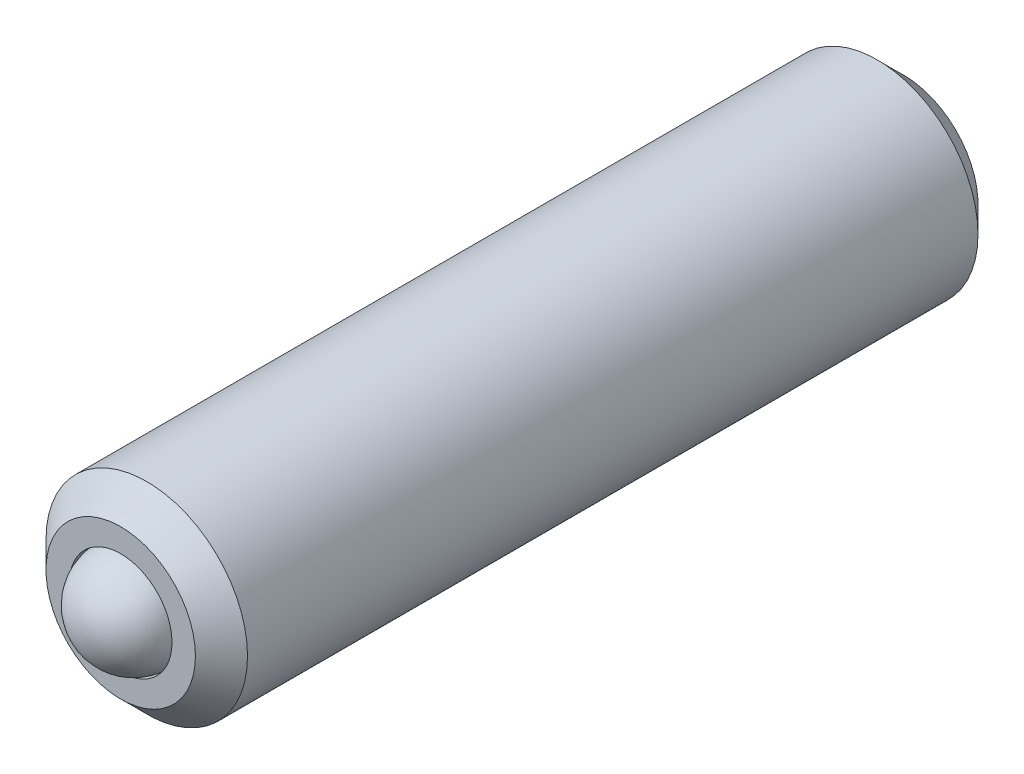
ISO-10303-21;
HEADER;
FILE_DESCRIPTION(('STEP AP214'),'2;1');
FILE_NAME('part.step','',(''),(''),'','','');
FILE_SCHEMA(('AUTOMOTIVE_DESIGN { 1 0 10303 214 1 1 1 1 }'));
ENDSEC;
DATA;
#1=APPLICATION_CONTEXT('core data for automotive mechanical design processes');
#2=APPLICATION_PROTOCOL_DEFINITION('international standard','automotive_design',2000,#1);
#3=PRODUCT_CONTEXT('',#1,'mechanical');
#4=PRODUCT('Part','Part','',(#3));
#5=PRODUCT_RELATED_PRODUCT_CATEGORY('part','',(#4));
#6=PRODUCT_DEFINITION_FORMATION('','',#4);
#7=PRODUCT_DEFINITION_CONTEXT('part definition',#1,'design');
#8=PRODUCT_DEFINITION('design','',#6,#7);
#9=PRODUCT_DEFINITION_SHAPE('','',#8);
#10=(LENGTH_UNIT() NAMED_UNIT(*) SI_UNIT(.MILLI.,.METRE.));
#11=(NAMED_UNIT(*) PLANE_ANGLE_UNIT() SI_UNIT($,.RADIAN.));
#12=(NAMED_UNIT(*) SI_UNIT($,.STERADIAN.) SOLID_ANGLE_UNIT());
#13=UNCERTAINTY_MEASURE_WITH_UNIT(LENGTH_MEASURE(1.E-05),#10,'distance_accuracy_value','');
#14=(GEOMETRIC_REPRESENTATION_CONTEXT(3) GLOBAL_UNCERTAINTY_ASSIGNED_CONTEXT((#13)) GLOBAL_UNIT_ASSIGNED_CONTEXT((#10,
#11,#12)) REPRESENTATION_CONTEXT('',''));
#15=CARTESIAN_POINT('',(0.,0.,0.));
#16=DIRECTION('',(0.,0.,1.));
#17=DIRECTION('',(1.,0.,0.));
#18=AXIS2_PLACEMENT_3D('',#15,#16,#17);
#19=CARTESIAN_POINT('',(-20.3726789582106,-21.6800178280325,29.1976536109388));
#20=DIRECTION('',(-0.249145001310561,-0.908967438814803,-0.334222924851688));
#21=DIRECTION('',(-0.928406450180372,0.322395159622823,-0.184723643086787));
#22=AXIS2_PLACEMENT_3D('',#19,#20,#21);
#23=SPHERICAL_SURFACE('',#22,0.5);
#24=CARTESIAN_POINT('',(-20.4972514588659,-22.1345015474399,29.0305421485129));
#25=VERTEX_POINT('',#24);
#26=VERTEX_LOOP('',#25);
#27=FACE_BOUND('',#26,.T.);
#28=ADVANCED_FACE('P0_F11',(#27),#23,.T.);
#29=CLOSED_SHELL('',(#28));
#30=MANIFOLD_SOLID_BREP('P0_B1',#29);
#31=CARTESIAN_POINT('',(-20.3726789582106,-21.6800178280323,29.3246536109386));
#32=DIRECTION('',(0.,0.,-1.));
#33=DIRECTION('',(-1.,0.,0.));
#34=AXIS2_PLACEMENT_3D('',#31,#32,#33);
#35=CYLINDRICAL_SURFACE('',#34,0.982);
#36=CARTESIAN_POINT('',(-20.3726789582106,-21.6800178280323,21.9516536109386));
#37=DIRECTION('',(0.,0.,-1.));
#38=DIRECTION('',(-1.,0.,0.));
#39=AXIS2_PLACEMENT_3D('',#36,#37,#38);
#40=CIRCLE('',#39,0.982);
#41=CARTESIAN_POINT('',(-21.3546789582106,-21.6800178280323,21.9516536109386));
#42=VERTEX_POINT('',#41);
#43=EDGE_CURVE('P1_E205',#42,#42,#40,.F.);
#44=ORIENTED_EDGE('',*,*,#43,.T.);
#45=EDGE_LOOP('',(#44));
#46=FACE_BOUND('',#45,.T.);
#47=CARTESIAN_POINT('',(-20.3726789582106,-21.6800178280323,29.0706536109386));
#48=DIRECTION('',(0.,0.,1.));
#49=DIRECTION('',(1.,0.,0.));
#50=AXIS2_PLACEMENT_3D('',#47,#48,#49);
#51=CIRCLE('',#50,0.982);
#52=CARTESIAN_POINT('',(-19.3906789582106,-21.6800178280323,29.0706536109386));
#53=VERTEX_POINT('',#52);
#54=EDGE_CURVE('P1_E209',#53,#53,#51,.F.);
#55=ORIENTED_EDGE('',*,*,#54,.T.);
#56=EDGE_LOOP('',(#55));
#57=FACE_BOUND('',#56,.T.);
#58=ADVANCED_FACE('P1_F15',(#46,#57),#35,.T.);
#59=CARTESIAN_POINT('',(-20.3726789582106,-21.6800178280323,29.3246536109386));
#60=DIRECTION('',(0.,0.,1.));
#61=DIRECTION('',(1.,0.,0.));
#62=AXIS2_PLACEMENT_3D('',#59,#60,#61);
#63=PLANE('',#62);
#64=CARTESIAN_POINT('',(-20.3726789582106,-21.6800178280323,29.3246536109386));
#65=DIRECTION('',(0.,0.,1.));
#66=DIRECTION('',(1.,0.,0.));
#67=AXIS2_PLACEMENT_3D('',#64,#65,#66);
#68=CIRCLE('',#67,0.728000000000002);
#69=CARTESIAN_POINT('',(-19.6446789582106,-21.6800178280323,29.3246536109386));
#70=VERTEX_POINT('',#69);
#71=EDGE_CURVE('P1_E29',#70,#70,#68,.T.);
#72=ORIENTED_EDGE('',*,*,#71,.T.);
#73=EDGE_LOOP('',(#72));
#74=FACE_BOUND('',#73,.T.);
#75=CARTESIAN_POINT('',(-20.3726789582106,-21.6800178280323,29.3246536109386));
#76=DIRECTION('',(0.,0.,1.));
#77=DIRECTION('',(1.,0.,0.));
#78=AXIS2_PLACEMENT_3D('',#75,#76,#77);
#79=CIRCLE('',#78,0.5);
#80=CARTESIAN_POINT('',(-19.8726789582106,-21.6800178280323,29.3246536109386));
#81=VERTEX_POINT('',#80);
#82=EDGE_CURVE('P1_E210',#81,#81,#79,.T.);
#83=ORIENTED_EDGE('',*,*,#82,.F.);
#84=EDGE_LOOP('',(#83));
#85=FACE_BOUND('',#84,.T.);
#86=ADVANCED_FACE('P1_F181',(#74,#85),#63,.T.);
#87=CARTESIAN_POINT('',(-20.3726789582106,-21.6800178280323,29.3246536109386));
#88=DIRECTION('',(0.,0.,1.));
#89=DIRECTION('',(1.,0.,0.));
#90=AXIS2_PLACEMENT_3D('',#87,#88,#89);
#91=CYLINDRICAL_SURFACE('',#90,0.5);
#92=CARTESIAN_POINT('',(-20.3726789582106,-21.6800178280323,28.9905468297521));
#93=DIRECTION('',(0.,0.,1.));
#94=DIRECTION('',(1.,0.,0.));
#95=AXIS2_PLACEMENT_3D('',#92,#93,#94);
#96=CIRCLE('',#95,0.5);
#97=CARTESIAN_POINT('',(-19.8726789582106,-21.6800178280323,28.9905468297521));
#98=VERTEX_POINT('',#97);
#99=EDGE_CURVE('P1_E215',#98,#98,#96,.T.);
#100=ORIENTED_EDGE('',*,*,#99,.F.);
#101=EDGE_LOOP('',(#100));
#102=FACE_BOUND('',#101,.T.);
#103=ORIENTED_EDGE('',*,*,#82,.T.);
#104=EDGE_LOOP('',(#103));
#105=FACE_BOUND('',#104,.T.);
#106=ADVANCED_FACE('P1_F187',(#102,#105),#91,.F.);
#107=CARTESIAN_POINT('',(-20.3726789582106,-21.6800178280323,28.9905468297521));
#108=DIRECTION('',(0.,0.,1.));
#109=DIRECTION('',(1.,0.,0.));
#110=AXIS2_PLACEMENT_3D('',#107,#108,#109);
#111=CONICAL_SURFACE('',#110,0.5,0.785398163397443);
#112=CARTESIAN_POINT('',(-20.3726789582106,-21.6800178280323,28.4905468297521));
#113=VERTEX_POINT('',#112);
#114=VERTEX_LOOP('',#113);
#115=FACE_BOUND('',#114,.T.);
#116=ORIENTED_EDGE('',*,*,#99,.T.);
#117=EDGE_LOOP('',(#116));
#118=FACE_BOUND('',#117,.T.);
#119=ADVANCED_FACE('P1_F201',(#115,#118),#111,.F.);
#120=CARTESIAN_POINT('',(-20.3726789582106,-21.6800178280323,21.6976536109386));
#121=DIRECTION('',(0.,0.,-1.));
#122=DIRECTION('',(-1.,0.,0.));
#123=AXIS2_PLACEMENT_3D('',#120,#121,#122);
#124=PLANE('',#123);
#125=CARTESIAN_POINT('',(-20.3726789582106,-21.6800178280323,21.6976536109386));
#126=DIRECTION('',(0.,0.,-1.));
#127=DIRECTION('',(-1.,0.,0.));
#128=AXIS2_PLACEMENT_3D('',#125,#126,#127);
#129=CIRCLE('',#128,0.635);
#130=CARTESIAN_POINT('',(-20.9226050896137,-21.3625178280323,21.6976536109386));
#131=VERTEX_POINT('',#130);
#132=CARTESIAN_POINT('',(-20.3726789582106,-21.0450178280323,21.6976536109386));
#133=VERTEX_POINT('',#132);
#134=EDGE_CURVE('P1_E35',#131,#133,#129,.T.);
#135=ORIENTED_EDGE('',*,*,#134,.F.);
#136=CARTESIAN_POINT('',(-20.9226050896137,-21.9975178280323,21.6976536109386));
#137=VERTEX_POINT('',#136);
#138=EDGE_CURVE('P1_E42',#137,#131,#129,.T.);
#139=ORIENTED_EDGE('',*,*,#138,.F.);
#140=CARTESIAN_POINT('',(-20.3726789582106,-22.3150178280323,21.6976536109386));
#141=VERTEX_POINT('',#140);
#142=EDGE_CURVE('P1_E115',#141,#137,#129,.T.);
#143=ORIENTED_EDGE('',*,*,#142,.F.);
#144=CARTESIAN_POINT('',(-19.8227528268075,-21.9975178280323,21.6976536109386));
#145=VERTEX_POINT('',#144);
#146=EDGE_CURVE('P1_E114',#145,#141,#129,.T.);
#147=ORIENTED_EDGE('',*,*,#146,.F.);
#148=CARTESIAN_POINT('',(-19.8227528268075,-21.3625178280323,21.6976536109386));
#149=VERTEX_POINT('',#148);
#150=EDGE_CURVE('P1_E85',#149,#145,#129,.T.);
#151=ORIENTED_EDGE('',*,*,#150,.F.);
#152=EDGE_CURVE('P1_E77',#133,#149,#129,.T.);
#153=ORIENTED_EDGE('',*,*,#152,.F.);
#154=EDGE_LOOP('',(#135,#139,#143,#147,#151,#153));
#155=FACE_BOUND('',#154,.T.);
#156=CARTESIAN_POINT('',(-20.3726789582106,-21.6800178280323,21.6976536109386));
#157=DIRECTION('',(0.,0.,-1.));
#158=DIRECTION('',(-1.,0.,0.));
#159=AXIS2_PLACEMENT_3D('',#156,#157,#158);
#160=CIRCLE('',#159,0.728000000000001);
#161=CARTESIAN_POINT('',(-21.1006789582106,-21.6800178280323,21.6976536109386));
#162=VERTEX_POINT('',#161);
#163=EDGE_CURVE('P1_E208',#162,#162,#160,.T.);
#164=ORIENTED_EDGE('',*,*,#163,.T.);
#165=EDGE_LOOP('',(#164));
#166=FACE_BOUND('',#165,.T.);
#167=ADVANCED_FACE('P1_F111',(#155,#166),#124,.T.);
#168=CARTESIAN_POINT('',(-20.3726789582106,-21.6800178280323,21.6976536109386));
#169=DIRECTION('',(0.,0.,1.));
#170=DIRECTION('',(1.,0.,0.));
#171=AXIS2_PLACEMENT_3D('',#168,#169,#170);
#172=CONICAL_SURFACE('',#171,0.728000000000001,0.785398163397445);
#173=ORIENTED_EDGE('',*,*,#43,.F.);
#174=EDGE_LOOP('',(#173));
#175=FACE_BOUND('',#174,.T.);
#176=ORIENTED_EDGE('',*,*,#163,.F.);
#177=EDGE_LOOP('',(#176));
#178=FACE_BOUND('',#177,.T.);
#179=ADVANCED_FACE('P1_F193',(#175,#178),#172,.T.);
#180=CARTESIAN_POINT('',(-20.3726789582106,-21.6800178280323,29.3246536109386));
#181=DIRECTION('',(0.,0.,-1.));
#182=DIRECTION('',(-1.,0.,0.));
#183=AXIS2_PLACEMENT_3D('',#180,#181,#182);
#184=CONICAL_SURFACE('',#183,0.728000000000002,0.785398163397446);
#185=ORIENTED_EDGE('',*,*,#54,.F.);
#186=EDGE_LOOP('',(#185));
#187=FACE_BOUND('',#186,.T.);
#188=ORIENTED_EDGE('',*,*,#71,.F.);
#189=EDGE_LOOP('',(#188));
#190=FACE_BOUND('',#189,.T.);
#191=ADVANCED_FACE('P1_F17',(#187,#190),#184,.T.);
#192=CARTESIAN_POINT('',(-20.3726789582106,-21.6800178280323,21.6976536109386));
#193=DIRECTION('',(0.,0.,-1.));
#194=DIRECTION('',(-1.,0.,0.));
#195=AXIS2_PLACEMENT_3D('',#192,#193,#194);
#196=CONICAL_SURFACE('',#195,0.635,0.785398163397448);
#197=ORIENTED_EDGE('',*,*,#150,.T.);
#198=CARTESIAN_POINT('',(-19.8227528268075,-22.3132424180526,21.4939688481067));
#199=CARTESIAN_POINT('',(-19.8227528268075,-22.2823909001988,21.5172099146467));
#200=CARTESIAN_POINT('',(-19.8227528268075,-22.251213105695,21.5400657672439));
#201=CARTESIAN_POINT('',(-19.8227528268075,-22.1876683318533,21.5845978100546));
#202=CARTESIAN_POINT('',(-19.8227528268075,-22.1552939755965,21.6062634124289));
#203=CARTESIAN_POINT('',(-19.8227528268075,-22.0874077420275,21.6488053700118));
#204=CARTESIAN_POINT('',(-19.8227528268075,-22.0518222540965,21.6695660895886));
#205=CARTESIAN_POINT('',(-19.8227528268075,-21.9788753698091,21.7075398785935));
#206=CARTESIAN_POINT('',(-19.8227528268075,-21.9415205046393,21.7247649078766));
#207=CARTESIAN_POINT('',(-19.8227528268075,-21.8854448981861,21.745836675686));
#208=CARTESIAN_POINT('',(-19.8227528268075,-21.8675573175111,21.7518841724672));
#209=CARTESIAN_POINT('',(-19.8227528268075,-21.8313599064794,21.7625469846191));
#210=CARTESIAN_POINT('',(-19.8227528268075,-21.8130500471268,21.7671622013257));
#211=CARTESIAN_POINT('',(-19.8227528268075,-21.7582538947398,21.7783144363237));
#212=CARTESIAN_POINT('',(-19.8227528268075,-21.7212188185361,21.7824322878855));
#213=CARTESIAN_POINT('',(-19.8227528268075,-21.6484324748955,21.7829814276612));
#214=CARTESIAN_POINT('',(-19.8227528268075,-21.6126832296478,21.779685381868));
#215=CARTESIAN_POINT('',(-19.8227528268075,-21.5596850471876,21.7699965410882));
#216=CARTESIAN_POINT('',(-19.8227528268075,-21.5419653393718,21.7659167333374));
#217=CARTESIAN_POINT('',(-19.8227528268075,-21.5069051321472,21.7563687164214));
#218=CARTESIAN_POINT('',(-19.8227528268075,-21.4895646011404,21.750900623429));
#219=CARTESIAN_POINT('',(-19.8227528268075,-21.4349719835981,21.7316271233804));
#220=CARTESIAN_POINT('',(-19.8227528268075,-21.3984994679091,21.7156258356001));
#221=CARTESIAN_POINT('',(-19.8227528268075,-21.3272665774506,21.6800464298624));
#222=CARTESIAN_POINT('',(-19.8227528268075,-21.2925129426756,21.6604554613015));
#223=CARTESIAN_POINT('',(-19.8227528268075,-21.2260925272151,21.6200491862186));
#224=CARTESIAN_POINT('',(-19.8227528268075,-21.1943581718682,21.5993430981416));
#225=CARTESIAN_POINT('',(-19.8227528268075,-21.1321139938961,21.556683468646));
#226=CARTESIAN_POINT('',(-19.8227528268075,-21.1015962806024,21.5347415110731));
#227=CARTESIAN_POINT('',(-19.8227528268075,-21.0714135593255,21.5123988298564));
#228=B_SPLINE_CURVE_WITH_KNOTS('',3,(#198,#199,#200,#201,#202,#203,#204,#205,#206,#207,#208,
#209,#210,#211,#212,#213,#214,#215,#216,#217,#218,#219,#220,#221,#222,#223,#224,#225,#226,#227),
.UNSPECIFIED.,.F.,.F.,(4,2,2,2,2,2,2,2,2,2,2,2,2,2,4),(0.,0.115919377669942,0.232742618789015,
0.356233992025999,0.479300496450956,0.535894602508558,0.592492606248893,0.70351197570278,
0.810515319981281,0.865016025394726,0.919512171643782,1.03864987361044,1.15822271572585,
1.27185363992294,1.38455547987617),.UNSPECIFIED.);
#229=EDGE_CURVE('P1_E10',#149,#145,#228,.F.);
#230=ORIENTED_EDGE('',*,*,#229,.F.);
#231=EDGE_LOOP('',(#197,#230));
#232=FACE_BOUND('',#231,.T.);
#233=ADVANCED_FACE('P1_F89',(#232),#196,.F.);
#234=ORIENTED_EDGE('',*,*,#146,.T.);
#235=CARTESIAN_POINT('',(-19.8225528268075,-21.9974023579785,21.6975381093944));
#236=CARTESIAN_POINT('',(-19.8414669625538,-22.0083224393431,21.7084524302981));
#237=CARTESIAN_POINT('',(-19.8606961875254,-22.0194244375567,21.71872717383));
#238=CARTESIAN_POINT('',(-19.8999072672086,-22.0420629649671,21.7375408256984));
#239=CARTESIAN_POINT('',(-19.9198928595233,-22.0536016520698,21.7460692531147));
#240=CARTESIAN_POINT('',(-19.9601955108029,-22.0768703986352,21.7606770486525));
#241=CARTESIAN_POINT('',(-19.9805022431313,-22.0885944960113,21.7667932092107));
#242=CARTESIAN_POINT('',(-20.0215531900858,-22.112295271286,21.7762242903237));
#243=CARTESIAN_POINT('',(-20.0422961720922,-22.1242712375312,21.7795462373648));
#244=CARTESIAN_POINT('',(-20.0929595076962,-22.1535217279803,21.7837606231526));
#245=CARTESIAN_POINT('',(-20.1229981860392,-22.1708645670077,21.7829986883647));
#246=CARTESIAN_POINT('',(-20.1824459599577,-22.2051867552822,21.775144622515));
#247=CARTESIAN_POINT('',(-20.211854047887,-22.2221655227646,21.7680430358229));
#248=CARTESIAN_POINT('',(-20.2635065321753,-22.2519870984727,21.7509150189757));
#249=CARTESIAN_POINT('',(-20.2859881482107,-22.2649668655426,21.7417811894753));
#250=CARTESIAN_POINT('',(-20.3300702917655,-22.2904177029904,21.7212043916752));
#251=CARTESIAN_POINT('',(-20.3516734171265,-22.302890273233,21.709768933685));
#252=CARTESIAN_POINT('',(-20.3728789582106,-22.3151332980861,21.6975381093944));
#253=B_SPLINE_CURVE_WITH_KNOTS('',3,(#235,#236,#237,#238,#239,#240,#241,#242,#243,#244,#245,
#246,#247,#248,#249,#250,#251,#252),.UNSPECIFIED.,.F.,.F.,(4,2,2,2,2,2,2,2,4),(0.,
0.0732955286089224,0.147018835182714,0.219569654599972,0.291937483545067,0.395361253462809,
0.498939538783553,0.581380863799344,0.66355741783438),.UNSPECIFIED.);
#254=EDGE_CURVE('P1_E117',#145,#141,#253,.T.);
#255=ORIENTED_EDGE('',*,*,#254,.F.);
#256=EDGE_LOOP('',(#234,#255));
#257=FACE_BOUND('',#256,.T.);
#258=ADVANCED_FACE('P1_F278',(#257),#196,.F.);
#259=ORIENTED_EDGE('',*,*,#142,.T.);
#260=CARTESIAN_POINT('',(-20.3724789582106,-22.3151332980861,21.6975381093944));
#261=CARTESIAN_POINT('',(-20.3913930939569,-22.3042132167215,21.7084524302981));
#262=CARTESIAN_POINT('',(-20.4106223189285,-22.2931112185079,21.71872717383));
#263=CARTESIAN_POINT('',(-20.4498333986117,-22.2704726910975,21.7375408256984));
#264=CARTESIAN_POINT('',(-20.4698189909264,-22.2589340039948,21.7460692531147));
#265=CARTESIAN_POINT('',(-20.510121642206,-22.2356652574294,21.7606770486525));
#266=CARTESIAN_POINT('',(-20.5304283745344,-22.2239411600533,21.7667932092107));
#267=CARTESIAN_POINT('',(-20.5714793214889,-22.2002403847786,21.7762242903237));
#268=CARTESIAN_POINT('',(-20.5922223034953,-22.1882644185334,21.7795462373648));
#269=CARTESIAN_POINT('',(-20.6428856390994,-22.1590139280843,21.7837606231526));
#270=CARTESIAN_POINT('',(-20.6729243174423,-22.1416710890569,21.7829986883647));
#271=CARTESIAN_POINT('',(-20.7323720913608,-22.1073489007824,21.775144622515));
#272=CARTESIAN_POINT('',(-20.7617801792902,-22.0903701333,21.7680430358229));
#273=CARTESIAN_POINT('',(-20.8134326635784,-22.0605485575919,21.7509150189757));
#274=CARTESIAN_POINT('',(-20.8359142796138,-22.047568790522,21.7417811894753));
#275=CARTESIAN_POINT('',(-20.8799964231686,-22.0221179530742,21.7212043916752));
#276=CARTESIAN_POINT('',(-20.9015995485297,-22.0096453828317,21.709768933685));
#277=CARTESIAN_POINT('',(-20.9228050896137,-21.9974023579785,21.6975381093944));
#278=B_SPLINE_CURVE_WITH_KNOTS('',3,(#260,#261,#262,#263,#264,#265,#266,#267,#268,#269,#270,
#271,#272,#273,#274,#275,#276,#277),.UNSPECIFIED.,.F.,.F.,(4,2,2,2,2,2,2,2,4),(0.,
0.0732955286089255,0.147018835182714,0.219569654599969,0.291937483545064,0.395361253462813,
0.498939538783557,0.581380863799343,0.663557417834381),.UNSPECIFIED.);
#279=EDGE_CURVE('P1_E125',#141,#137,#278,.T.);
#280=ORIENTED_EDGE('',*,*,#279,.F.);
#281=EDGE_LOOP('',(#259,#280));
#282=FACE_BOUND('',#281,.T.);
#283=ADVANCED_FACE('P1_F275',(#282),#196,.F.);
#284=ORIENTED_EDGE('',*,*,#138,.T.);
#285=CARTESIAN_POINT('',(-20.9226050896137,-22.3132424179605,21.4939688481763));
#286=CARTESIAN_POINT('',(-20.9226050896137,-22.2823909001119,21.5172099147109));
#287=CARTESIAN_POINT('',(-20.9226050896137,-22.2512131056133,21.5400657673028));
#288=CARTESIAN_POINT('',(-20.9226050896137,-22.1876683317822,21.5845978101028));
#289=CARTESIAN_POINT('',(-20.9226050896137,-22.1552939755309,21.6062634124717));
#290=CARTESIAN_POINT('',(-20.9226050896137,-22.0874077419738,21.6488053700437));
#291=CARTESIAN_POINT('',(-20.9226050896137,-22.0518222540492,21.6695660896149));
#292=CARTESIAN_POINT('',(-20.9226050896137,-21.9788753697753,21.7075398786095));
#293=CARTESIAN_POINT('',(-20.9226050896137,-21.9415205046125,21.7247649078878));
#294=CARTESIAN_POINT('',(-20.9226050896137,-21.8854448981646,21.7458366756936));
#295=CARTESIAN_POINT('',(-20.9226050896137,-21.8675573174874,21.7518841724749));
#296=CARTESIAN_POINT('',(-20.9226050896137,-21.8313599064512,21.7625469846266));
#297=CARTESIAN_POINT('',(-20.9226050896137,-21.8130500470963,21.767162201333));
#298=CARTESIAN_POINT('',(-20.9226050896137,-21.7582538947027,21.7783144363292));
#299=CARTESIAN_POINT('',(-20.9226050896137,-21.7212188184945,21.7824322878889));
#300=CARTESIAN_POINT('',(-20.9226050896137,-21.648432474846,21.7829814276586));
#301=CARTESIAN_POINT('',(-20.9226050896137,-21.6126832295948,21.7796853818617));
#302=CARTESIAN_POINT('',(-20.9226050896137,-21.5596850471299,21.7699965410759));
#303=CARTESIAN_POINT('',(-20.9226050896137,-21.5419653393125,21.765916733323));
#304=CARTESIAN_POINT('',(-20.9226050896137,-21.5069051320849,21.7563687164027));
#305=CARTESIAN_POINT('',(-20.9226050896137,-21.4895646010767,21.7509006234082));
#306=CARTESIAN_POINT('',(-20.9226050896137,-21.4349719835206,21.7316271233494));
#307=CARTESIAN_POINT('',(-20.9226050896137,-21.3984994678198,21.7156258355597));
#308=CARTESIAN_POINT('',(-20.9226050896137,-21.3272665773387,21.6800464298022));
#309=CARTESIAN_POINT('',(-20.9226050896137,-21.2925129425528,21.660455461231));
#310=CARTESIAN_POINT('',(-20.9226050896137,-21.2260925270729,21.6200491861282));
#311=CARTESIAN_POINT('',(-20.9226050896137,-21.1943581717172,21.5993430980417));
#312=CARTESIAN_POINT('',(-20.9226050896137,-21.1321139937281,21.5566834685274));
#313=CARTESIAN_POINT('',(-20.9226050896137,-21.1015962804259,21.5347415109452));
#314=CARTESIAN_POINT('',(-20.9226050896137,-21.0714135591406,21.5123988297192));
#315=B_SPLINE_CURVE_WITH_KNOTS('',3,(#285,#286,#287,#288,#289,#290,#291,#292,#293,#294,#295,
#296,#297,#298,#299,#300,#301,#302,#303,#304,#305,#306,#307,#308,#309,#310,#311,#312,#313,#314),
.UNSPECIFIED.,.F.,.F.,(4,2,2,2,2,2,2,2,2,2,2,2,2,2,4),(0.,0.115919377647877,0.232742618744472,
0.356233991956241,0.479300496356226,0.535894602420214,0.592492606166933,0.703511975633009,
0.810515319922696,0.865016025342176,0.919512171597261,1.03864987360729,1.15822271576635,
1.2718536400008,1.38455547999086),.UNSPECIFIED.);
#316=EDGE_CURVE('P1_E145',#137,#131,#315,.T.);
#317=ORIENTED_EDGE('',*,*,#316,.F.);
#318=EDGE_LOOP('',(#284,#317));
#319=FACE_BOUND('',#318,.T.);
#320=ADVANCED_FACE('P1_F277',(#319),#196,.F.);
#321=ORIENTED_EDGE('',*,*,#134,.T.);
#322=CARTESIAN_POINT('',(-20.9228050896137,-21.3626332980861,21.6975381093944));
#323=CARTESIAN_POINT('',(-20.9038909538674,-21.3517132167215,21.7084524302981));
#324=CARTESIAN_POINT('',(-20.8846617288958,-21.3406112185079,21.71872717383));
#325=CARTESIAN_POINT('',(-20.8454506492126,-21.3179726910975,21.7375408256984));
#326=CARTESIAN_POINT('',(-20.8254650568979,-21.3064340039948,21.7460692531147));
#327=CARTESIAN_POINT('',(-20.7851624056183,-21.2831652574294,21.7606770486525));
#328=CARTESIAN_POINT('',(-20.7648556732899,-21.2714411600533,21.7667932092107));
#329=CARTESIAN_POINT('',(-20.7238047263354,-21.2477403847786,21.7762242903237));
#330=CARTESIAN_POINT('',(-20.703061744329,-21.2357644185334,21.7795462373648));
#331=CARTESIAN_POINT('',(-20.652398408725,-21.2065139280843,21.7837606231526));
#332=CARTESIAN_POINT('',(-20.622359730382,-21.1891710890569,21.7829986883647));
#333=CARTESIAN_POINT('',(-20.5629119564635,-21.1548489007824,21.775144622515));
#334=CARTESIAN_POINT('',(-20.5335038685342,-21.1378701333,21.7680430358229));
#335=CARTESIAN_POINT('',(-20.4818513842459,-21.1080485575919,21.7509150189757));
#336=CARTESIAN_POINT('',(-20.4593697682105,-21.095068790522,21.7417811894753));
#337=CARTESIAN_POINT('',(-20.4152876246557,-21.0696179530742,21.7212043916752));
#338=CARTESIAN_POINT('',(-20.3936844992947,-21.0571453828317,21.709768933685));
#339=CARTESIAN_POINT('',(-20.3724789582106,-21.0449023579785,21.6975381093944));
#340=B_SPLINE_CURVE_WITH_KNOTS('',3,(#322,#323,#324,#325,#326,#327,#328,#329,#330,#331,#332,
#333,#334,#335,#336,#337,#338,#339),.UNSPECIFIED.,.F.,.F.,(4,2,2,2,2,2,2,2,4),(0.,
0.073295528608924,0.147018835182715,0.219569654599974,0.291937483545068,0.395361253462811,
0.498939538783555,0.581380863799346,0.663557417834381),.UNSPECIFIED.);
#341=EDGE_CURVE('P1_E101',#131,#133,#340,.T.);
#342=ORIENTED_EDGE('',*,*,#341,.F.);
#343=EDGE_LOOP('',(#321,#342));
#344=FACE_BOUND('',#343,.T.);
#345=ADVANCED_FACE('P1_F138',(#344),#196,.F.);
#346=ORIENTED_EDGE('',*,*,#152,.T.);
#347=CARTESIAN_POINT('',(-20.3728789582106,-21.0449023579785,21.6975381093944));
#348=CARTESIAN_POINT('',(-20.3539648224643,-21.0558224393431,21.7084524302981));
#349=CARTESIAN_POINT('',(-20.3347355974927,-21.0669244375567,21.71872717383));
#350=CARTESIAN_POINT('',(-20.2955245178095,-21.0895629649671,21.7375408256984));
#351=CARTESIAN_POINT('',(-20.2755389254948,-21.1011016520698,21.7460692531147));
#352=CARTESIAN_POINT('',(-20.2352362742152,-21.1243703986352,21.7606770486525));
#353=CARTESIAN_POINT('',(-20.2149295418868,-21.1360944960114,21.7667932092107));
#354=CARTESIAN_POINT('',(-20.1738785949323,-21.159795271286,21.7762242903237));
#355=CARTESIAN_POINT('',(-20.1531356129259,-21.1717712375312,21.7795462373648));
#356=CARTESIAN_POINT('',(-20.1024722773218,-21.2010217279803,21.7837606231526));
#357=CARTESIAN_POINT('',(-20.0724335989789,-21.2183645670077,21.7829986883647));
#358=CARTESIAN_POINT('',(-20.0129858250604,-21.2526867552822,21.775144622515));
#359=CARTESIAN_POINT('',(-19.983577737131,-21.2696655227646,21.7680430358229));
#360=CARTESIAN_POINT('',(-19.9319252528428,-21.2994870984727,21.7509150189757));
#361=CARTESIAN_POINT('',(-19.9094436368074,-21.3124668655426,21.7417811894753));
#362=CARTESIAN_POINT('',(-19.8653614932526,-21.3379177029904,21.7212043916752));
#363=CARTESIAN_POINT('',(-19.8437583678915,-21.350390273233,21.709768933685));
#364=CARTESIAN_POINT('',(-19.8225528268075,-21.3626332980861,21.6975381093944));
#365=B_SPLINE_CURVE_WITH_KNOTS('',3,(#347,#348,#349,#350,#351,#352,#353,#354,#355,#356,#357,
#358,#359,#360,#361,#362,#363,#364),.UNSPECIFIED.,.F.,.F.,(4,2,2,2,2,2,2,2,4),(0.,
0.0732955286089255,0.147018835182714,0.219569654599969,0.291937483545064,0.39536125346281,
0.498939538783556,0.581380863799343,0.663557417834381),.UNSPECIFIED.);
#366=EDGE_CURVE('P1_E81',#133,#149,#365,.T.);
#367=ORIENTED_EDGE('',*,*,#366,.F.);
#368=EDGE_LOOP('',(#346,#367));
#369=FACE_BOUND('',#368,.T.);
#370=ADVANCED_FACE('P1_F79',(#369),#196,.F.);
#371=CARTESIAN_POINT('',(-20.3726789582106,-21.6800178280323,23.7296536109386));
#372=DIRECTION('',(0.,0.,1.));
#373=DIRECTION('',(1.,0.,0.));
#374=AXIS2_PLACEMENT_3D('',#371,#372,#373);
#375=PLANE('',#374);
#376=DIRECTION('',(0.866025403784439,-0.5,0.));
#377=VECTOR('',#376,1.);
#378=CARTESIAN_POINT('',(-19.8227528268075,-21.3625178280323,23.7296536109386));
#379=LINE('',#378,#377);
#380=CARTESIAN_POINT('',(-20.3726789582106,-21.0450178280323,23.7296536109386));
#381=VERTEX_POINT('',#380);
#382=CARTESIAN_POINT('',(-19.8227528268075,-21.3625178280323,23.7296536109386));
#383=VERTEX_POINT('',#382);
#384=EDGE_CURVE('P1_E100',#381,#383,#379,.T.);
#385=ORIENTED_EDGE('',*,*,#384,.T.);
#386=DIRECTION('',(0.,-1.,0.));
#387=VECTOR('',#386,1.);
#388=CARTESIAN_POINT('',(-19.8227528268075,-21.9975178280323,23.7296536109386));
#389=LINE('',#388,#387);
#390=CARTESIAN_POINT('',(-19.8227528268075,-21.9975178280323,23.7296536109386));
#391=VERTEX_POINT('',#390);
#392=EDGE_CURVE('P1_E105',#383,#391,#389,.T.);
#393=ORIENTED_EDGE('',*,*,#392,.T.);
#394=DIRECTION('',(-0.866025403784439,-0.5,0.));
#395=VECTOR('',#394,1.);
#396=CARTESIAN_POINT('',(-20.3726789582106,-22.3150178280323,23.7296536109386));
#397=LINE('',#396,#395);
#398=CARTESIAN_POINT('',(-20.3726789582106,-22.3150178280323,23.7296536109386));
#399=VERTEX_POINT('',#398);
#400=EDGE_CURVE('P1_E247',#391,#399,#397,.T.);
#401=ORIENTED_EDGE('',*,*,#400,.T.);
#402=DIRECTION('',(-0.866025403784439,0.5,0.));
#403=VECTOR('',#402,1.);
#404=CARTESIAN_POINT('',(-20.9226050896137,-21.9975178280323,23.7296536109386));
#405=LINE('',#404,#403);
#406=CARTESIAN_POINT('',(-20.9226050896137,-21.9975178280323,23.7296536109386));
#407=VERTEX_POINT('',#406);
#408=EDGE_CURVE('P1_E251',#399,#407,#405,.T.);
#409=ORIENTED_EDGE('',*,*,#408,.T.);
#410=DIRECTION('',(0.,1.,0.));
#411=VECTOR('',#410,1.);
#412=CARTESIAN_POINT('',(-20.9226050896137,-21.3625178280323,23.7296536109386));
#413=LINE('',#412,#411);
#414=CARTESIAN_POINT('',(-20.9226050896137,-21.3625178280323,23.7296536109386));
#415=VERTEX_POINT('',#414);
#416=EDGE_CURVE('P1_E254',#407,#415,#413,.T.);
#417=ORIENTED_EDGE('',*,*,#416,.T.);
#418=DIRECTION('',(0.866025403784439,0.5,0.));
#419=VECTOR('',#418,1.);
#420=CARTESIAN_POINT('',(-20.3726789582106,-21.0450178280323,23.7296536109386));
#421=LINE('',#420,#419);
#422=EDGE_CURVE('P1_E108',#415,#381,#421,.T.);
#423=ORIENTED_EDGE('',*,*,#422,.T.);
#424=EDGE_LOOP('',(#385,#393,#401,#409,#417,#423));
#425=FACE_BOUND('',#424,.T.);
#426=ADVANCED_FACE('P1_F137',(#425),#375,.F.);
#427=CARTESIAN_POINT('',(-19.8227528268075,-21.9975178280323,23.7296536109386));
#428=DIRECTION('',(1.,0.,0.));
#429=DIRECTION('',(0.,1.,0.));
#430=AXIS2_PLACEMENT_3D('',#427,#428,#429);
#431=PLANE('',#430);
#432=DIRECTION('',(0.,0.,-1.));
#433=VECTOR('',#432,1.);
#434=CARTESIAN_POINT('',(-19.8227528268075,-21.3625178280323,23.7296536109386));
#435=LINE('',#434,#433);
#436=EDGE_CURVE('P1_E97',#383,#149,#435,.T.);
#437=ORIENTED_EDGE('',*,*,#436,.T.);
#438=ORIENTED_EDGE('',*,*,#229,.T.);
#439=DIRECTION('',(0.,0.,-1.));
#440=VECTOR('',#439,1.);
#441=CARTESIAN_POINT('',(-19.8227528268075,-21.9975178280323,23.7296536109386));
#442=LINE('',#441,#440);
#443=EDGE_CURVE('P1_E107',#391,#145,#442,.T.);
#444=ORIENTED_EDGE('',*,*,#443,.F.);
#445=ORIENTED_EDGE('',*,*,#392,.F.);
#446=EDGE_LOOP('',(#437,#438,#444,#445));
#447=FACE_BOUND('',#446,.T.);
#448=ADVANCED_FACE('P1_F103',(#447),#431,.F.);
#449=CARTESIAN_POINT('',(-20.3726789582106,-22.3150178280323,23.7296536109386));
#450=DIRECTION('',(0.5,-0.866025403784439,0.));
#451=DIRECTION('',(0.866025403784439,0.5,0.));
#452=AXIS2_PLACEMENT_3D('',#449,#450,#451);
#453=PLANE('',#452);
#454=ORIENTED_EDGE('',*,*,#443,.T.);
#455=ORIENTED_EDGE('',*,*,#254,.T.);
#456=DIRECTION('',(0.,0.,-1.));
#457=VECTOR('',#456,1.);
#458=CARTESIAN_POINT('',(-20.3726789582106,-22.3150178280323,23.7296536109386));
#459=LINE('',#458,#457);
#460=EDGE_CURVE('P1_E263',#399,#141,#459,.T.);
#461=ORIENTED_EDGE('',*,*,#460,.F.);
#462=ORIENTED_EDGE('',*,*,#400,.F.);
#463=EDGE_LOOP('',(#454,#455,#461,#462));
#464=FACE_BOUND('',#463,.T.);
#465=ADVANCED_FACE('P1_F132',(#464),#453,.F.);
#466=CARTESIAN_POINT('',(-20.9226050896137,-21.9975178280323,23.7296536109386));
#467=DIRECTION('',(-0.5,-0.866025403784439,0.));
#468=DIRECTION('',(0.866025403784439,-0.5,0.));
#469=AXIS2_PLACEMENT_3D('',#466,#467,#468);
#470=PLANE('',#469);
#471=ORIENTED_EDGE('',*,*,#460,.T.);
#472=ORIENTED_EDGE('',*,*,#279,.T.);
#473=DIRECTION('',(0.,0.,-1.));
#474=VECTOR('',#473,1.);
#475=CARTESIAN_POINT('',(-20.9226050896137,-21.9975178280323,23.7296536109386));
#476=LINE('',#475,#474);
#477=EDGE_CURVE('P1_E261',#407,#137,#476,.T.);
#478=ORIENTED_EDGE('',*,*,#477,.F.);
#479=ORIENTED_EDGE('',*,*,#408,.F.);
#480=EDGE_LOOP('',(#471,#472,#478,#479));
#481=FACE_BOUND('',#480,.T.);
#482=ADVANCED_FACE('P1_F169',(#481),#470,.F.);
#483=CARTESIAN_POINT('',(-20.9226050896137,-21.3625178280323,23.7296536109386));
#484=DIRECTION('',(-1.,0.,0.));
#485=DIRECTION('',(0.,-1.,0.));
#486=AXIS2_PLACEMENT_3D('',#483,#484,#485);
#487=PLANE('',#486);
#488=ORIENTED_EDGE('',*,*,#477,.T.);
#489=ORIENTED_EDGE('',*,*,#316,.T.);
#490=DIRECTION('',(0.,0.,-1.));
#491=VECTOR('',#490,1.);
#492=CARTESIAN_POINT('',(-20.9226050896137,-21.3625178280323,23.7296536109386));
#493=LINE('',#492,#491);
#494=EDGE_CURVE('P1_E258',#415,#131,#493,.T.);
#495=ORIENTED_EDGE('',*,*,#494,.F.);
#496=ORIENTED_EDGE('',*,*,#416,.F.);
#497=EDGE_LOOP('',(#488,#489,#495,#496));
#498=FACE_BOUND('',#497,.T.);
#499=ADVANCED_FACE('P1_F165',(#498),#487,.F.);
#500=CARTESIAN_POINT('',(-20.3726789582106,-21.0450178280323,23.7296536109386));
#501=DIRECTION('',(-0.5,0.866025403784439,0.));
#502=DIRECTION('',(-0.866025403784439,-0.5,0.));
#503=AXIS2_PLACEMENT_3D('',#500,#501,#502);
#504=PLANE('',#503);
#505=ORIENTED_EDGE('',*,*,#494,.T.);
#506=ORIENTED_EDGE('',*,*,#341,.T.);
#507=DIRECTION('',(0.,0.,-1.));
#508=VECTOR('',#507,1.);
#509=CARTESIAN_POINT('',(-20.3726789582106,-21.0450178280323,23.7296536109386));
#510=LINE('',#509,#508);
#511=EDGE_CURVE('P1_E99',#381,#133,#510,.T.);
#512=ORIENTED_EDGE('',*,*,#511,.F.);
#513=ORIENTED_EDGE('',*,*,#422,.F.);
#514=EDGE_LOOP('',(#505,#506,#512,#513));
#515=FACE_BOUND('',#514,.T.);
#516=ADVANCED_FACE('P1_F162',(#515),#504,.F.);
#517=CARTESIAN_POINT('',(-19.8227528268075,-21.3625178280323,23.7296536109386));
#518=DIRECTION('',(0.5,0.866025403784439,0.));
#519=DIRECTION('',(-0.866025403784439,0.5,0.));
#520=AXIS2_PLACEMENT_3D('',#517,#518,#519);
#521=PLANE('',#520);
#522=ORIENTED_EDGE('',*,*,#511,.T.);
#523=ORIENTED_EDGE('',*,*,#366,.T.);
#524=ORIENTED_EDGE('',*,*,#436,.F.);
#525=ORIENTED_EDGE('',*,*,#384,.F.);
#526=EDGE_LOOP('',(#522,#523,#524,#525));
#527=FACE_BOUND('',#526,.T.);
#528=ADVANCED_FACE('P1_F95',(#527),#521,.F.);
#529=CLOSED_SHELL('',(#58,#86,#106,#119,#167,#179,#191,#233,#258,#283,#320,#345,#370,#426,#448,
#465,#482,#499,#516,#528));
#530=MANIFOLD_SOLID_BREP('P1_B1',#529);
#531=ADVANCED_BREP_SHAPE_REPRESENTATION('',(#18,#30,#530),#14);
#532=SHAPE_DEFINITION_REPRESENTATION(#9,#531);
ENDSEC;
END-ISO-10303-21;
